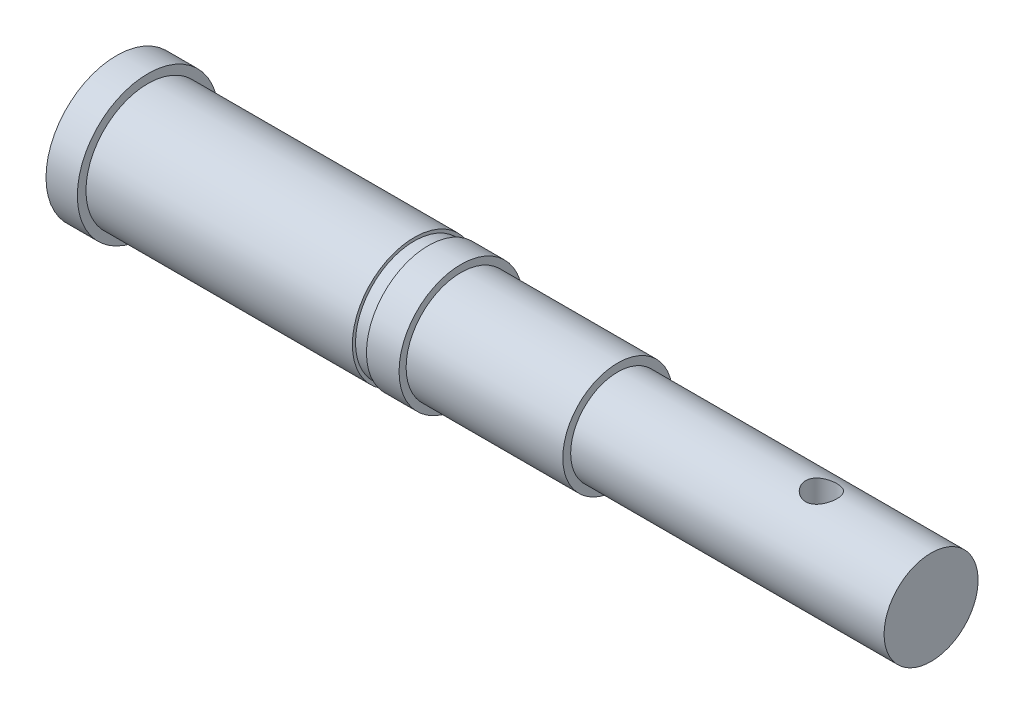
ISO-10303-21;
HEADER;
FILE_DESCRIPTION(('STEP AP214'),'2;1');
FILE_NAME('part.step','',(''),(''),'','','');
FILE_SCHEMA(('AUTOMOTIVE_DESIGN { 1 0 10303 214 1 1 1 1 }'));
ENDSEC;
DATA;
#1=APPLICATION_CONTEXT('core data for automotive mechanical design processes');
#2=APPLICATION_PROTOCOL_DEFINITION('international standard','automotive_design',2000,#1);
#3=PRODUCT_CONTEXT('',#1,'mechanical');
#4=PRODUCT('Part','Part','',(#3));
#5=PRODUCT_RELATED_PRODUCT_CATEGORY('part','',(#4));
#6=PRODUCT_DEFINITION_FORMATION('','',#4);
#7=PRODUCT_DEFINITION_CONTEXT('part definition',#1,'design');
#8=PRODUCT_DEFINITION('design','',#6,#7);
#9=PRODUCT_DEFINITION_SHAPE('','',#8);
#10=(LENGTH_UNIT() NAMED_UNIT(*) SI_UNIT(.MILLI.,.METRE.));
#11=(NAMED_UNIT(*) PLANE_ANGLE_UNIT() SI_UNIT($,.RADIAN.));
#12=(NAMED_UNIT(*) SI_UNIT($,.STERADIAN.) SOLID_ANGLE_UNIT());
#13=UNCERTAINTY_MEASURE_WITH_UNIT(LENGTH_MEASURE(1.E-05),#10,'distance_accuracy_value','');
#14=(GEOMETRIC_REPRESENTATION_CONTEXT(3) GLOBAL_UNCERTAINTY_ASSIGNED_CONTEXT((#13)) GLOBAL_UNIT_ASSIGNED_CONTEXT((#10,
#11,#12)) REPRESENTATION_CONTEXT('',''));
#15=CARTESIAN_POINT('',(0.,0.,0.));
#16=DIRECTION('',(0.,0.,1.));
#17=DIRECTION('',(1.,0.,0.));
#18=AXIS2_PLACEMENT_3D('',#15,#16,#17);
#19=CARTESIAN_POINT('',(-33.4090909090909,4.5,0.));
#20=DIRECTION('',(1.,0.,0.));
#21=DIRECTION('',(0.,0.,-1.));
#22=AXIS2_PLACEMENT_3D('',#19,#20,#21);
#23=PLANE('',#22);
#24=CARTESIAN_POINT('',(-33.4090909090909,0.,0.));
#25=DIRECTION('',(-1.,0.,0.));
#26=DIRECTION('',(0.,0.,1.));
#27=AXIS2_PLACEMENT_3D('',#24,#25,#26);
#28=CIRCLE('',#27,4.5);
#29=CARTESIAN_POINT('',(-33.4090909090909,0.,4.5));
#30=VERTEX_POINT('',#29);
#31=EDGE_CURVE('E118',#30,#30,#28,.T.);
#32=ORIENTED_EDGE('',*,*,#31,.T.);
#33=EDGE_LOOP('',(#32));
#34=FACE_BOUND('',#33,.T.);
#35=ADVANCED_FACE('F33',(#34),#23,.F.);
#36=CARTESIAN_POINT('',(18.5709090909091,0.,0.));
#37=DIRECTION('',(-1.,0.,0.));
#38=DIRECTION('',(0.,0.,1.));
#39=AXIS2_PLACEMENT_3D('',#36,#37,#38);
#40=PLANE('',#39);
#41=CARTESIAN_POINT('',(18.5709090909091,0.,0.));
#42=DIRECTION('',(-1.,0.,0.));
#43=DIRECTION('',(0.,0.,1.));
#44=AXIS2_PLACEMENT_3D('',#41,#42,#43);
#45=CIRCLE('',#44,3.00000000000001);
#46=CARTESIAN_POINT('',(18.5709090909091,0.,3.00000000000001));
#47=VERTEX_POINT('',#46);
#48=EDGE_CURVE('E10',#47,#47,#45,.T.);
#49=ORIENTED_EDGE('',*,*,#48,.F.);
#50=EDGE_LOOP('',(#49));
#51=FACE_BOUND('',#50,.T.);
#52=ADVANCED_FACE('F106',(#51),#40,.F.);
#53=CARTESIAN_POINT('',(-66.1363636363637,0.,0.));
#54=DIRECTION('',(-1.,0.,0.));
#55=DIRECTION('',(0.,0.,1.));
#56=AXIS2_PLACEMENT_3D('',#53,#54,#55);
#57=CYLINDRICAL_SURFACE('',#56,3.00000000000001);
#58=CARTESIAN_POINT('',(11.5709090909091,-2.8284271247462,1.));
#59=CARTESIAN_POINT('',(11.6253772657198,-2.82842694532736,1.00000025794781));
#60=CARTESIAN_POINT('',(11.6798438906806,-2.83001769372807,0.995534783698144));
#61=CARTESIAN_POINT('',(11.7871635118597,-2.83617574174581,0.977851131702568));
#62=CARTESIAN_POINT('',(11.840016240773,-2.84074353167221,0.964631512170677));
#63=CARTESIAN_POINT('',(11.9425359839219,-2.85228203663889,0.929955485680266));
#64=CARTESIAN_POINT('',(11.992209020356,-2.85924803964642,0.908515221402004));
#65=CARTESIAN_POINT('',(12.0872691394529,-2.87479122017009,0.85806162844263));
#66=CARTESIAN_POINT('',(12.1326552734616,-2.88336875305433,0.829046628860525));
#67=CARTESIAN_POINT('',(12.2196290532486,-2.9015448940559,0.76305114644253));
#68=CARTESIAN_POINT('',(12.2610245195811,-2.9111689484414,0.725824341377828));
#69=CARTESIAN_POINT('',(12.3371158921334,-2.9301386480151,0.644987667214493));
#70=CARTESIAN_POINT('',(12.3718107224914,-2.939484248291,0.601376775052405));
#71=CARTESIAN_POINT('',(12.4343879882388,-2.9571386692166,0.507604507964987));
#72=CARTESIAN_POINT('',(12.4620690615271,-2.96541407701569,0.457301911224521));
#73=CARTESIAN_POINT('',(12.5085006760366,-2.97969586771022,0.352431222987483));
#74=CARTESIAN_POINT('',(12.527253624086,-2.98570286203013,0.297864285687216));
#75=CARTESIAN_POINT('',(12.5546449455415,-2.99459075431899,0.188028817433494));
#76=CARTESIAN_POINT('',(12.5636125371661,-2.99757314777559,0.132850754852969));
#77=CARTESIAN_POINT('',(12.5722253842698,-3.0004360821825,0.0216978748240922));
#78=CARTESIAN_POINT('',(12.5718730425615,-3.00031742262892,-0.0342767335438917));
#79=CARTESIAN_POINT('',(12.5620648363431,-2.99706039618737,-0.143103515193816));
#80=CARTESIAN_POINT('',(12.5529665624346,-2.99404064755136,-0.195992048591666));
#81=CARTESIAN_POINT('',(12.5265161099286,-2.98546967339715,-0.29944343882216));
#82=CARTESIAN_POINT('',(12.5091633719293,-2.97991827631116,-0.350006137779175));
#83=CARTESIAN_POINT('',(12.466487773603,-2.96675670293293,-0.448152474842012));
#84=CARTESIAN_POINT('',(12.4410631523623,-2.95912042524271,-0.495688220968997));
#85=CARTESIAN_POINT('',(12.3830493854607,-2.94258393038666,-0.585924325527168));
#86=CARTESIAN_POINT('',(12.3504582475825,-2.93368336200519,-0.628623334384769));
#87=CARTESIAN_POINT('',(12.2772346974484,-2.91506191850891,-0.710100866551906));
#88=CARTESIAN_POINT('',(12.2362959330636,-2.90532215172668,-0.748600157067555));
#89=CARTESIAN_POINT('',(12.1484603651864,-2.88647335245112,-0.818277259595889));
#90=CARTESIAN_POINT('',(12.1015626451959,-2.87736441731451,-0.849453943273004));
#91=CARTESIAN_POINT('',(12.0022554652937,-2.86070525135532,-0.903987455042731));
#92=CARTESIAN_POINT('',(11.9497769595413,-2.85317909338823,-0.927226463651048));
#93=CARTESIAN_POINT('',(11.8413376966428,-2.840816508783,-0.964443193299505));
#94=CARTESIAN_POINT('',(11.7853784096873,-2.83597895501224,-0.978424795755528));
#95=CARTESIAN_POINT('',(11.6742707355085,-2.82979636302072,-0.996161282090473));
#96=CARTESIAN_POINT('',(11.6191996661634,-2.8283036031514,-1.00034909550575));
#97=CARTESIAN_POINT('',(11.5091329417921,-2.82856672062802,-0.999605438911603));
#98=CARTESIAN_POINT('',(11.4541372748843,-2.83032200792769,-0.994675625227259));
#99=CARTESIAN_POINT('',(11.3477521251979,-2.8367361808938,-0.976225651551829));
#100=CARTESIAN_POINT('',(11.2963036607585,-2.84129325440595,-0.963006393980554));
#101=CARTESIAN_POINT('',(11.1963654846697,-2.85268553671271,-0.928713862560595));
#102=CARTESIAN_POINT('',(11.1478762993183,-2.85952114934908,-0.907639196363456));
#103=CARTESIAN_POINT('',(11.0535286700621,-2.87496877595719,-0.857474340738899));
#104=CARTESIAN_POINT('',(11.0078024482673,-2.88363025665611,-0.828151118358486));
#105=CARTESIAN_POINT('',(10.9217630385254,-2.90165768730985,-0.762585630557566));
#106=CARTESIAN_POINT('',(10.8814514522479,-2.91102384443801,-0.726341325498782));
#107=CARTESIAN_POINT('',(10.8053811068185,-2.92995038637845,-0.64589170590032));
#108=CARTESIAN_POINT('',(10.7699347008902,-2.93949843577896,-0.601387270546648));
#109=CARTESIAN_POINT('',(10.706992948561,-2.95726851613111,-0.506827291400254));
#110=CARTESIAN_POINT('',(10.6794973197467,-2.96549059417696,-0.456771944864549));
#111=CARTESIAN_POINT('',(10.6334889860474,-2.97964405810604,-0.352779862432292));
#112=CARTESIAN_POINT('',(10.614917813761,-2.98559030004532,-0.298871123321193));
#113=CARTESIAN_POINT('',(10.587181348849,-2.99458610837776,-0.188458465846013));
#114=CARTESIAN_POINT('',(10.5780126610286,-2.99763672034019,-0.131955491953886));
#115=CARTESIAN_POINT('',(10.5696470133034,-3.00041863236258,-0.0208153358600372));
#116=CARTESIAN_POINT('',(10.5700016369767,-3.00029920089443,0.0337847239200226));
#117=CARTESIAN_POINT('',(10.5795663990555,-2.99712196519397,0.142111145000177));
#118=CARTESIAN_POINT('',(10.5887758190619,-2.99406439933568,0.195837576819059));
#119=CARTESIAN_POINT('',(10.6154913254851,-2.98540914954422,0.300042119432064));
#120=CARTESIAN_POINT('',(10.632863306262,-2.97985258361181,0.350558270912799));
#121=CARTESIAN_POINT('',(10.6752866220062,-2.96677160704465,0.447978350939793));
#122=CARTESIAN_POINT('',(10.700339346106,-2.95924684047902,0.494881624142414));
#123=CARTESIAN_POINT('',(10.7584786030112,-2.94265868828002,0.585634016308813));
#124=CARTESIAN_POINT('',(10.791827776291,-2.93354872492382,0.629306251557701));
#125=CARTESIAN_POINT('',(10.865166482065,-2.91492988791426,0.710581026272342));
#126=CARTESIAN_POINT('',(10.9051581331708,-2.90542088771398,0.748181621624263));
#127=CARTESIAN_POINT('',(10.9925184464971,-2.88663279827366,0.817741808833468));
#128=CARTESIAN_POINT('',(11.0401146018899,-2.87737727995346,0.849422965999221));
#129=CARTESIAN_POINT('',(11.1402435178077,-2.86060193316304,0.904314343299803));
#130=CARTESIAN_POINT('',(11.1927749839233,-2.85308165136171,0.927526776814563));
#131=CARTESIAN_POINT('',(11.2988709149329,-2.84101334230536,0.96384382820663));
#132=CARTESIAN_POINT('',(11.3522813544748,-2.83634632944801,0.977357909163272));
#133=CARTESIAN_POINT('',(11.4607651414246,-2.83005383613941,0.995434320161698));
#134=CARTESIAN_POINT('',(11.5158379083448,-2.82842730615136,0.999999739196506));
#135=CARTESIAN_POINT('',(11.5709090909091,-2.8284271247462,1.));
#136=B_SPLINE_CURVE_WITH_KNOTS('',3,(#58,#59,#60,#61,#62,#63,#64,#65,#66,#67,#68,#69,#70,#71,
#72,#73,#74,#75,#76,#77,#78,#79,#80,#81,#82,#83,#84,#85,#86,#87,#88,#89,#90,#91,#92,#93,#94,#95,
#96,#97,#98,#99,#100,#101,#102,#103,#104,#105,#106,#107,#108,#109,#110,#111,#112,#113,#114,#115,
#116,#117,#118,#119,#120,#121,#122,#123,#124,#125,#126,#127,#128,#129,#130,#131,#132,#133,#134,
#135),.UNSPECIFIED.,.T.,.F.,(4,2,2,2,2,2,2,2,2,2,2,2,2,2,2,2,2,2,2,2,2,2,2,2,2,2,2,2,2,2,2,2,2,
2,2,2,2,2,4),(0.,0.163200584775419,0.326428054968882,0.489336627454547,0.65228116613916,
0.8210133742294,0.989772651673597,1.16293506139029,1.33605076382161,1.50314318760306,
1.67019253297699,1.83069004820941,1.99119844184609,2.15381654855707,2.31647991869394,
2.4868017435929,2.65714979607478,2.82992639837376,3.00263051349689,3.16754291357513,
3.33242535830307,3.49164395761849,3.65089079140019,3.81518857728788,3.97953485655201,
4.15178808164166,4.32403518750606,4.49513791183925,4.6661788299723,4.82918084670709,
4.99216964002855,5.15256956033503,5.31299850756316,5.47935519513707,5.64576504425705,
5.81868902729218,5.9915677825994,6.15663212153687,6.3216394717923),.UNSPECIFIED.);
#137=CARTESIAN_POINT('',(11.5709090909091,-2.8284271247462,1.));
#138=VERTEX_POINT('',#137);
#139=EDGE_CURVE('E36',#138,#138,#136,.T.);
#140=ORIENTED_EDGE('',*,*,#139,.T.);
#141=EDGE_LOOP('',(#140));
#142=FACE_BOUND('',#141,.T.);
#143=CARTESIAN_POINT('',(11.5709090909091,2.8284271247462,1.));
#144=CARTESIAN_POINT('',(11.5164409160984,2.82842694532736,1.00000025794781));
#145=CARTESIAN_POINT('',(11.4619742911376,2.83001769372807,0.995534783698144));
#146=CARTESIAN_POINT('',(11.3546546699585,2.83617574174581,0.977851131702568));
#147=CARTESIAN_POINT('',(11.3018019410452,2.84074353167221,0.964631512170677));
#148=CARTESIAN_POINT('',(11.1992821978963,2.85228203663889,0.929955485680266));
#149=CARTESIAN_POINT('',(11.1496091614622,2.85924803964642,0.908515221402004));
#150=CARTESIAN_POINT('',(11.0545490423653,2.87479122017009,0.85806162844263));
#151=CARTESIAN_POINT('',(11.0091629083566,2.88336875305433,0.829046628860525));
#152=CARTESIAN_POINT('',(10.9221891285696,2.9015448940559,0.76305114644253));
#153=CARTESIAN_POINT('',(10.880793662237,2.9111689484414,0.725824341377828));
#154=CARTESIAN_POINT('',(10.8047022896848,2.9301386480151,0.644987667214493));
#155=CARTESIAN_POINT('',(10.7700074593268,2.939484248291,0.601376775052405));
#156=CARTESIAN_POINT('',(10.7074301935794,2.9571386692166,0.507604507964987));
#157=CARTESIAN_POINT('',(10.6797491202911,2.96541407701569,0.457301911224521));
#158=CARTESIAN_POINT('',(10.6333175057816,2.97969586771022,0.352431222987483));
#159=CARTESIAN_POINT('',(10.6145645577322,2.98570286203013,0.297864285687216));
#160=CARTESIAN_POINT('',(10.5871732362767,2.99459075431899,0.188028817433494));
#161=CARTESIAN_POINT('',(10.5782056446521,2.99757314777559,0.132850754852969));
#162=CARTESIAN_POINT('',(10.5695927975484,3.0004360821825,0.0216978748240922));
#163=CARTESIAN_POINT('',(10.5699451392567,3.00031742262892,-0.0342767335438917));
#164=CARTESIAN_POINT('',(10.5797533454751,2.99706039618737,-0.143103515193816));
#165=CARTESIAN_POINT('',(10.5888516193836,2.99404064755136,-0.195992048591666));
#166=CARTESIAN_POINT('',(10.6153020718895,2.98546967339715,-0.29944343882216));
#167=CARTESIAN_POINT('',(10.6326548098888,2.97991827631116,-0.350006137779174));
#168=CARTESIAN_POINT('',(10.6753304082152,2.96675670293293,-0.448152474842013));
#169=CARTESIAN_POINT('',(10.7007550294559,2.95912042524271,-0.495688220968998));
#170=CARTESIAN_POINT('',(10.7587687963575,2.94258393038666,-0.585924325527169));
#171=CARTESIAN_POINT('',(10.7913599342357,2.93368336200519,-0.628623334384769));
#172=CARTESIAN_POINT('',(10.8645834843698,2.91506191850891,-0.710100866551906));
#173=CARTESIAN_POINT('',(10.9055222487545,2.90532215172668,-0.748600157067555));
#174=CARTESIAN_POINT('',(10.9933578166317,2.88647335245112,-0.818277259595889));
#175=CARTESIAN_POINT('',(11.0402555366223,2.87736441731451,-0.849453943273004));
#176=CARTESIAN_POINT('',(11.1395627165245,2.86070525135532,-0.903987455042732));
#177=CARTESIAN_POINT('',(11.1920412222769,2.85317909338823,-0.927226463651049));
#178=CARTESIAN_POINT('',(11.3004804851754,2.840816508783,-0.964443193299506));
#179=CARTESIAN_POINT('',(11.3564397721309,2.83597895501224,-0.978424795755529));
#180=CARTESIAN_POINT('',(11.4675474463097,2.82979636302072,-0.996161282090473));
#181=CARTESIAN_POINT('',(11.5226185156548,2.8283036031514,-1.00034909550575));
#182=CARTESIAN_POINT('',(11.6326852400261,2.82856672062802,-0.999605438911603));
#183=CARTESIAN_POINT('',(11.6876809069339,2.83032200792769,-0.994675625227259));
#184=CARTESIAN_POINT('',(11.7940660566203,2.8367361808938,-0.976225651551829));
#185=CARTESIAN_POINT('',(11.8455145210597,2.84129325440595,-0.963006393980554));
#186=CARTESIAN_POINT('',(11.9454526971485,2.85268553671271,-0.928713862560595));
#187=CARTESIAN_POINT('',(11.9939418824999,2.85952114934908,-0.907639196363456));
#188=CARTESIAN_POINT('',(12.088289511756,2.87496877595719,-0.857474340738899));
#189=CARTESIAN_POINT('',(12.1340157335509,2.88363025665611,-0.828151118358486));
#190=CARTESIAN_POINT('',(12.2200551432928,2.90165768730985,-0.762585630557566));
#191=CARTESIAN_POINT('',(12.2603667295703,2.91102384443801,-0.726341325498782));
#192=CARTESIAN_POINT('',(12.3364370749997,2.92995038637845,-0.645891705900319));
#193=CARTESIAN_POINT('',(12.3718834809279,2.93949843577896,-0.601387270546648));
#194=CARTESIAN_POINT('',(12.4348252332571,2.95726851613111,-0.506827291400254));
#195=CARTESIAN_POINT('',(12.4623208620715,2.96549059417696,-0.456771944864549));
#196=CARTESIAN_POINT('',(12.5083291957708,2.97964405810604,-0.352779862432292));
#197=CARTESIAN_POINT('',(12.5269003680572,2.98559030004532,-0.298871123321193));
#198=CARTESIAN_POINT('',(12.5546368329692,2.99458610837776,-0.188458465846013));
#199=CARTESIAN_POINT('',(12.5638055207896,2.99763672034019,-0.131955491953886));
#200=CARTESIAN_POINT('',(12.5721711685147,3.00041863236258,-0.0208153358600372));
#201=CARTESIAN_POINT('',(12.5718165448415,3.00029920089443,0.0337847239200226));
#202=CARTESIAN_POINT('',(12.5622517827627,2.99712196519397,0.142111145000177));
#203=CARTESIAN_POINT('',(12.5530423627563,2.99406439933568,0.195837576819059));
#204=CARTESIAN_POINT('',(12.5263268563331,2.98540914954422,0.300042119432064));
#205=CARTESIAN_POINT('',(12.5089548755561,2.97985258361181,0.350558270912799));
#206=CARTESIAN_POINT('',(12.466531559812,2.96677160704465,0.447978350939793));
#207=CARTESIAN_POINT('',(12.4414788357122,2.95924684047902,0.494881624142414));
#208=CARTESIAN_POINT('',(12.383339578807,2.94265868828002,0.585634016308813));
#209=CARTESIAN_POINT('',(12.3499904055272,2.93354872492382,0.629306251557701));
#210=CARTESIAN_POINT('',(12.2766516997532,2.91492988791426,0.710581026272342));
#211=CARTESIAN_POINT('',(12.2366600486474,2.90542088771398,0.748181621624263));
#212=CARTESIAN_POINT('',(12.1492997353211,2.88663279827366,0.817741808833468));
#213=CARTESIAN_POINT('',(12.1017035799283,2.87737727995346,0.849422965999221));
#214=CARTESIAN_POINT('',(12.0015746640104,2.86060193316304,0.904314343299803));
#215=CARTESIAN_POINT('',(11.9490431978948,2.85308165136171,0.927526776814563));
#216=CARTESIAN_POINT('',(11.8429472668853,2.84101334230536,0.963843828206631));
#217=CARTESIAN_POINT('',(11.7895368273434,2.83634632944801,0.977357909163272));
#218=CARTESIAN_POINT('',(11.6810530403936,2.83005383613941,0.995434320161698));
#219=CARTESIAN_POINT('',(11.6259802734733,2.82842730615136,0.999999739196506));
#220=CARTESIAN_POINT('',(11.5709090909091,2.8284271247462,1.));
#221=B_SPLINE_CURVE_WITH_KNOTS('',3,(#143,#144,#145,#146,#147,#148,#149,#150,#151,#152,#153,
#154,#155,#156,#157,#158,#159,#160,#161,#162,#163,#164,#165,#166,#167,#168,#169,#170,#171,#172,
#173,#174,#175,#176,#177,#178,#179,#180,#181,#182,#183,#184,#185,#186,#187,#188,#189,#190,#191,
#192,#193,#194,#195,#196,#197,#198,#199,#200,#201,#202,#203,#204,#205,#206,#207,#208,#209,#210,
#211,#212,#213,#214,#215,#216,#217,#218,#219,#220),.UNSPECIFIED.,.T.,.F.,(4,2,2,2,2,2,2,2,2,2,2,
2,2,2,2,2,2,2,2,2,2,2,2,2,2,2,2,2,2,2,2,2,2,2,2,2,2,2,4),(0.,0.163200584775419,
0.326428054968882,0.489336627454547,0.65228116613916,0.8210133742294,0.989772651673597,
1.16293506139029,1.33605076382161,1.50314318760306,1.67019253297699,1.83069004820941,
1.99119844184609,2.15381654855707,2.31647991869394,2.4868017435929,2.65714979607478,
2.82992639837377,3.00263051349689,3.16754291357513,3.33242535830307,3.49164395761849,
3.65089079140019,3.81518857728788,3.97953485655201,4.15178808164166,4.32403518750606,
4.49513791183925,4.6661788299723,4.82918084670709,4.99216964002855,5.15256956033503,
5.31299850756316,5.47935519513707,5.64576504425705,5.81868902729218,5.9915677825994,
6.15663212153687,6.3216394717923),.UNSPECIFIED.);
#222=CARTESIAN_POINT('',(11.5709090909091,2.8284271247462,1.));
#223=VERTEX_POINT('',#222);
#224=EDGE_CURVE('E52',#223,#223,#221,.T.);
#225=ORIENTED_EDGE('',*,*,#224,.T.);
#226=EDGE_LOOP('',(#225));
#227=FACE_BOUND('',#226,.T.);
#228=CARTESIAN_POINT('',(-1.42909090909091,0.,0.));
#229=DIRECTION('',(-1.,0.,0.));
#230=DIRECTION('',(0.,0.,1.));
#231=AXIS2_PLACEMENT_3D('',#228,#229,#230);
#232=CIRCLE('',#231,3.00000000000001);
#233=CARTESIAN_POINT('',(-1.42909090909091,0.,3.00000000000001));
#234=VERTEX_POINT('',#233);
#235=EDGE_CURVE('E44',#234,#234,#232,.T.);
#236=ORIENTED_EDGE('',*,*,#235,.F.);
#237=EDGE_LOOP('',(#236));
#238=FACE_BOUND('',#237,.T.);
#239=ORIENTED_EDGE('',*,*,#48,.T.);
#240=EDGE_LOOP('',(#239));
#241=FACE_BOUND('',#240,.T.);
#242=ADVANCED_FACE('F56',(#142,#227,#238,#241),#57,.T.);
#243=CARTESIAN_POINT('',(-1.42909090909091,3.00000000000001,0.));
#244=DIRECTION('',(-1.,0.,0.));
#245=DIRECTION('',(0.,0.,1.));
#246=AXIS2_PLACEMENT_3D('',#243,#244,#245);
#247=PLANE('',#246);
#248=CARTESIAN_POINT('',(-1.42909090909091,0.,0.));
#249=DIRECTION('',(-1.,0.,0.));
#250=DIRECTION('',(0.,0.,1.));
#251=AXIS2_PLACEMENT_3D('',#248,#249,#250);
#252=CIRCLE('',#251,3.50000000000001);
#253=CARTESIAN_POINT('',(-1.42909090909091,0.,3.50000000000001));
#254=VERTEX_POINT('',#253);
#255=EDGE_CURVE('E49',#254,#254,#252,.T.);
#256=ORIENTED_EDGE('',*,*,#255,.F.);
#257=EDGE_LOOP('',(#256));
#258=FACE_BOUND('',#257,.T.);
#259=ORIENTED_EDGE('',*,*,#235,.T.);
#260=EDGE_LOOP('',(#259));
#261=FACE_BOUND('',#260,.T.);
#262=ADVANCED_FACE('F99',(#258,#261),#247,.F.);
#263=CARTESIAN_POINT('',(-66.1363636363637,0.,0.));
#264=DIRECTION('',(-1.,0.,0.));
#265=DIRECTION('',(0.,0.,1.));
#266=AXIS2_PLACEMENT_3D('',#263,#264,#265);
#267=CYLINDRICAL_SURFACE('',#266,3.50000000000001);
#268=CARTESIAN_POINT('',(-11.4290909090909,0.,0.));
#269=DIRECTION('',(-1.,0.,0.));
#270=DIRECTION('',(0.,0.,1.));
#271=AXIS2_PLACEMENT_3D('',#268,#269,#270);
#272=CIRCLE('',#271,3.50000000000001);
#273=CARTESIAN_POINT('',(-11.4290909090909,0.,3.50000000000001));
#274=VERTEX_POINT('',#273);
#275=EDGE_CURVE('E143',#274,#274,#272,.T.);
#276=ORIENTED_EDGE('',*,*,#275,.F.);
#277=EDGE_LOOP('',(#276));
#278=FACE_BOUND('',#277,.T.);
#279=ORIENTED_EDGE('',*,*,#255,.T.);
#280=EDGE_LOOP('',(#279));
#281=FACE_BOUND('',#280,.T.);
#282=ADVANCED_FACE('F96',(#278,#281),#267,.T.);
#283=CARTESIAN_POINT('',(-11.4290909090909,3.95000000000001,0.));
#284=DIRECTION('',(-1.,0.,0.));
#285=DIRECTION('',(0.,0.,1.));
#286=AXIS2_PLACEMENT_3D('',#283,#284,#285);
#287=PLANE('',#286);
#288=CARTESIAN_POINT('',(-11.4290909090909,0.,0.));
#289=DIRECTION('',(-1.,0.,0.));
#290=DIRECTION('',(0.,0.,1.));
#291=AXIS2_PLACEMENT_3D('',#288,#289,#290);
#292=CIRCLE('',#291,3.95000000000001);
#293=CARTESIAN_POINT('',(-11.4290909090909,0.,3.95000000000001));
#294=VERTEX_POINT('',#293);
#295=EDGE_CURVE('E140',#294,#294,#292,.T.);
#296=ORIENTED_EDGE('',*,*,#295,.F.);
#297=EDGE_LOOP('',(#296));
#298=FACE_BOUND('',#297,.T.);
#299=ORIENTED_EDGE('',*,*,#275,.T.);
#300=EDGE_LOOP('',(#299));
#301=FACE_BOUND('',#300,.T.);
#302=ADVANCED_FACE('F92',(#298,#301),#287,.F.);
#303=CARTESIAN_POINT('',(-66.1363636363637,0.,0.));
#304=DIRECTION('',(-1.,0.,0.));
#305=DIRECTION('',(0.,0.,1.));
#306=AXIS2_PLACEMENT_3D('',#303,#304,#305);
#307=CYLINDRICAL_SURFACE('',#306,3.95000000000001);
#308=CARTESIAN_POINT('',(-13.5090909090909,0.,0.));
#309=DIRECTION('',(-1.,0.,0.));
#310=DIRECTION('',(0.,0.,1.));
#311=AXIS2_PLACEMENT_3D('',#308,#309,#310);
#312=CIRCLE('',#311,3.95000000000001);
#313=CARTESIAN_POINT('',(-13.5090909090909,0.,3.95000000000001));
#314=VERTEX_POINT('',#313);
#315=EDGE_CURVE('E137',#314,#314,#312,.T.);
#316=ORIENTED_EDGE('',*,*,#315,.F.);
#317=EDGE_LOOP('',(#316));
#318=FACE_BOUND('',#317,.T.);
#319=ORIENTED_EDGE('',*,*,#295,.T.);
#320=EDGE_LOOP('',(#319));
#321=FACE_BOUND('',#320,.T.);
#322=ADVANCED_FACE('F88',(#318,#321),#307,.T.);
#323=CARTESIAN_POINT('',(-13.5090909090909,3.95000000000001,0.));
#324=DIRECTION('',(1.,0.,0.));
#325=DIRECTION('',(0.,0.,-1.));
#326=AXIS2_PLACEMENT_3D('',#323,#324,#325);
#327=PLANE('',#326);
#328=CARTESIAN_POINT('',(-13.5090909090909,0.,0.));
#329=DIRECTION('',(-1.,0.,0.));
#330=DIRECTION('',(0.,0.,1.));
#331=AXIS2_PLACEMENT_3D('',#328,#329,#330);
#332=CIRCLE('',#331,3.75);
#333=CARTESIAN_POINT('',(-13.5090909090909,0.,3.75));
#334=VERTEX_POINT('',#333);
#335=EDGE_CURVE('E134',#334,#334,#332,.T.);
#336=ORIENTED_EDGE('',*,*,#335,.F.);
#337=EDGE_LOOP('',(#336));
#338=FACE_BOUND('',#337,.T.);
#339=ORIENTED_EDGE('',*,*,#315,.T.);
#340=EDGE_LOOP('',(#339));
#341=FACE_BOUND('',#340,.T.);
#342=ADVANCED_FACE('F84',(#338,#341),#327,.F.);
#343=CARTESIAN_POINT('',(-66.1363636363637,0.,0.));
#344=DIRECTION('',(-1.,0.,0.));
#345=DIRECTION('',(0.,0.,1.));
#346=AXIS2_PLACEMENT_3D('',#343,#344,#345);
#347=CYLINDRICAL_SURFACE('',#346,3.75);
#348=CARTESIAN_POINT('',(-14.4090909090909,0.,0.));
#349=DIRECTION('',(-1.,0.,0.));
#350=DIRECTION('',(0.,0.,1.));
#351=AXIS2_PLACEMENT_3D('',#348,#349,#350);
#352=CIRCLE('',#351,3.75);
#353=CARTESIAN_POINT('',(-14.4090909090909,0.,3.75));
#354=VERTEX_POINT('',#353);
#355=EDGE_CURVE('E131',#354,#354,#352,.T.);
#356=ORIENTED_EDGE('',*,*,#355,.F.);
#357=EDGE_LOOP('',(#356));
#358=FACE_BOUND('',#357,.T.);
#359=ORIENTED_EDGE('',*,*,#335,.T.);
#360=EDGE_LOOP('',(#359));
#361=FACE_BOUND('',#360,.T.);
#362=ADVANCED_FACE('F80',(#358,#361),#347,.T.);
#363=CARTESIAN_POINT('',(-14.4090909090909,3.95000000000001,0.));
#364=DIRECTION('',(-1.,0.,0.));
#365=DIRECTION('',(0.,0.,1.));
#366=AXIS2_PLACEMENT_3D('',#363,#364,#365);
#367=PLANE('',#366);
#368=CARTESIAN_POINT('',(-14.4090909090909,0.,0.));
#369=DIRECTION('',(-1.,0.,0.));
#370=DIRECTION('',(0.,0.,1.));
#371=AXIS2_PLACEMENT_3D('',#368,#369,#370);
#372=CIRCLE('',#371,3.95000000000001);
#373=CARTESIAN_POINT('',(-14.4090909090909,0.,3.95000000000001));
#374=VERTEX_POINT('',#373);
#375=EDGE_CURVE('E128',#374,#374,#372,.T.);
#376=ORIENTED_EDGE('',*,*,#375,.F.);
#377=EDGE_LOOP('',(#376));
#378=FACE_BOUND('',#377,.T.);
#379=ORIENTED_EDGE('',*,*,#355,.T.);
#380=EDGE_LOOP('',(#379));
#381=FACE_BOUND('',#380,.T.);
#382=ADVANCED_FACE('F76',(#378,#381),#367,.F.);
#383=CARTESIAN_POINT('',(-66.1363636363637,0.,0.));
#384=DIRECTION('',(-1.,0.,0.));
#385=DIRECTION('',(0.,0.,1.));
#386=AXIS2_PLACEMENT_3D('',#383,#384,#385);
#387=CYLINDRICAL_SURFACE('',#386,3.95);
#388=CARTESIAN_POINT('',(-31.4090909090909,0.,0.));
#389=DIRECTION('',(-1.,0.,0.));
#390=DIRECTION('',(0.,0.,1.));
#391=AXIS2_PLACEMENT_3D('',#388,#389,#390);
#392=CIRCLE('',#391,3.95);
#393=CARTESIAN_POINT('',(-31.4090909090909,0.,3.95));
#394=VERTEX_POINT('',#393);
#395=EDGE_CURVE('E122',#394,#394,#392,.T.);
#396=ORIENTED_EDGE('',*,*,#395,.F.);
#397=EDGE_LOOP('',(#396));
#398=FACE_BOUND('',#397,.T.);
#399=ORIENTED_EDGE('',*,*,#375,.T.);
#400=EDGE_LOOP('',(#399));
#401=FACE_BOUND('',#400,.T.);
#402=ADVANCED_FACE('F72',(#398,#401),#387,.T.);
#403=CARTESIAN_POINT('',(-31.4090909090909,3.95,0.));
#404=DIRECTION('',(-1.,0.,0.));
#405=DIRECTION('',(0.,0.,1.));
#406=AXIS2_PLACEMENT_3D('',#403,#404,#405);
#407=PLANE('',#406);
#408=CARTESIAN_POINT('',(-31.4090909090909,0.,0.));
#409=DIRECTION('',(-1.,0.,0.));
#410=DIRECTION('',(0.,0.,1.));
#411=AXIS2_PLACEMENT_3D('',#408,#409,#410);
#412=CIRCLE('',#411,4.5);
#413=CARTESIAN_POINT('',(-31.4090909090909,0.,4.5));
#414=VERTEX_POINT('',#413);
#415=EDGE_CURVE('E119',#414,#414,#412,.T.);
#416=ORIENTED_EDGE('',*,*,#415,.F.);
#417=EDGE_LOOP('',(#416));
#418=FACE_BOUND('',#417,.T.);
#419=ORIENTED_EDGE('',*,*,#395,.T.);
#420=EDGE_LOOP('',(#419));
#421=FACE_BOUND('',#420,.T.);
#422=ADVANCED_FACE('F68',(#418,#421),#407,.F.);
#423=CARTESIAN_POINT('',(-66.1363636363637,0.,0.));
#424=DIRECTION('',(-1.,0.,0.));
#425=DIRECTION('',(0.,0.,1.));
#426=AXIS2_PLACEMENT_3D('',#423,#424,#425);
#427=CYLINDRICAL_SURFACE('',#426,4.5);
#428=ORIENTED_EDGE('',*,*,#31,.F.);
#429=EDGE_LOOP('',(#428));
#430=FACE_BOUND('',#429,.T.);
#431=ORIENTED_EDGE('',*,*,#415,.T.);
#432=EDGE_LOOP('',(#431));
#433=FACE_BOUND('',#432,.T.);
#434=ADVANCED_FACE('F63',(#430,#433),#427,.T.);
#435=CARTESIAN_POINT('',(11.5709090909091,-5.,0.));
#436=DIRECTION('',(0.,1.,0.));
#437=DIRECTION('',(0.,0.,1.));
#438=AXIS2_PLACEMENT_3D('',#435,#436,#437);
#439=CYLINDRICAL_SURFACE('',#438,1.);
#440=ORIENTED_EDGE('',*,*,#224,.F.);
#441=EDGE_LOOP('',(#440));
#442=FACE_BOUND('',#441,.T.);
#443=ORIENTED_EDGE('',*,*,#139,.F.);
#444=EDGE_LOOP('',(#443));
#445=FACE_BOUND('',#444,.T.);
#446=ADVANCED_FACE('F59',(#442,#445),#439,.F.);
#447=CLOSED_SHELL('',(#35,#52,#242,#262,#282,#302,#322,#342,#362,#382,#402,#422,#434,#446));
#448=MANIFOLD_SOLID_BREP('B2',#447);
#449=ADVANCED_BREP_SHAPE_REPRESENTATION('',(#18,#448),#14);
#450=SHAPE_DEFINITION_REPRESENTATION(#9,#449);
ENDSEC;
END-ISO-10303-21;
